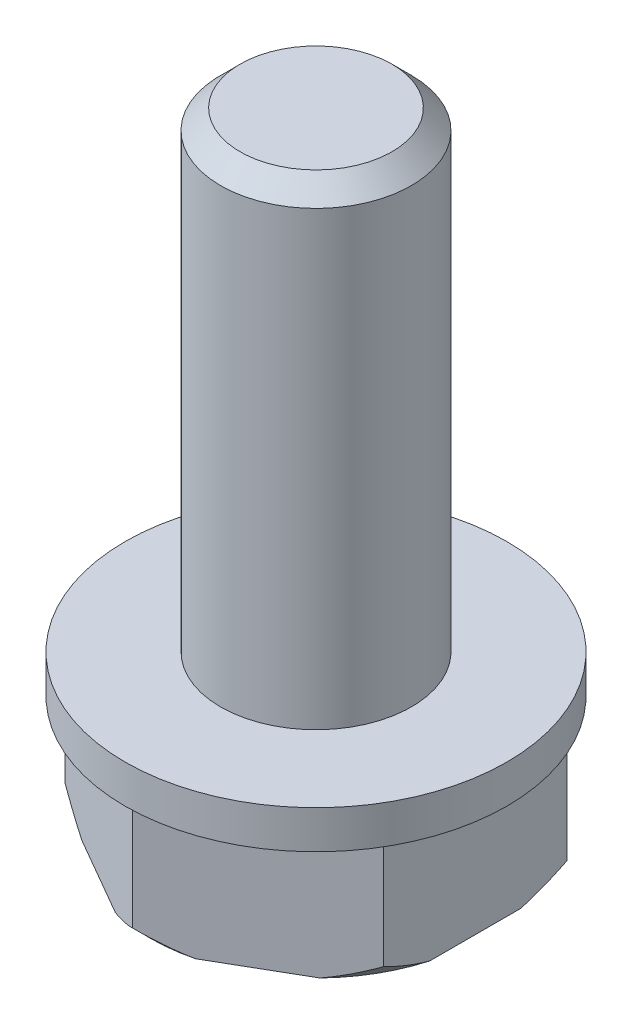
ISO-10303-21;
HEADER;
FILE_DESCRIPTION(('STEP AP214'),'2;1');
FILE_NAME('part.step','',(''),(''),'','','');
FILE_SCHEMA(('AUTOMOTIVE_DESIGN { 1 0 10303 214 1 1 1 1 }'));
ENDSEC;
DATA;
#1=APPLICATION_CONTEXT('core data for automotive mechanical design processes');
#2=APPLICATION_PROTOCOL_DEFINITION('international standard','automotive_design',2000,#1);
#3=PRODUCT_CONTEXT('',#1,'mechanical');
#4=PRODUCT('Part','Part','',(#3));
#5=PRODUCT_RELATED_PRODUCT_CATEGORY('part','',(#4));
#6=PRODUCT_DEFINITION_FORMATION('','',#4);
#7=PRODUCT_DEFINITION_CONTEXT('part definition',#1,'design');
#8=PRODUCT_DEFINITION('design','',#6,#7);
#9=PRODUCT_DEFINITION_SHAPE('','',#8);
#10=(LENGTH_UNIT() NAMED_UNIT(*) SI_UNIT(.MILLI.,.METRE.));
#11=(NAMED_UNIT(*) PLANE_ANGLE_UNIT() SI_UNIT($,.RADIAN.));
#12=(NAMED_UNIT(*) SI_UNIT($,.STERADIAN.) SOLID_ANGLE_UNIT());
#13=UNCERTAINTY_MEASURE_WITH_UNIT(LENGTH_MEASURE(1.E-05),#10,'distance_accuracy_value','');
#14=(GEOMETRIC_REPRESENTATION_CONTEXT(3) GLOBAL_UNCERTAINTY_ASSIGNED_CONTEXT((#13)) GLOBAL_UNIT_ASSIGNED_CONTEXT((#10,
#11,#12)) REPRESENTATION_CONTEXT('',''));
#15=CARTESIAN_POINT('',(0.,0.,0.));
#16=DIRECTION('',(0.,0.,1.));
#17=DIRECTION('',(1.,0.,0.));
#18=AXIS2_PLACEMENT_3D('',#15,#16,#17);
#19=CARTESIAN_POINT('',(-12.6776695296637,96.5,14.7909181837156));
#20=DIRECTION('',(-0.5,0.,0.866025403784439));
#21=DIRECTION('',(0.866025403784439,0.,0.5));
#22=AXIS2_PLACEMENT_3D('',#19,#20,#21);
#23=PLANE('',#22);
#24=DIRECTION('',(0.,-1.,0.));
#25=VECTOR('',#24,1.);
#26=CARTESIAN_POINT('',(-12.6776695296637,96.5,14.7909181837156));
#27=LINE('',#26,#25);
#28=CARTESIAN_POINT('',(-12.6776695296637,50.5,14.7909181837156));
#29=VERTEX_POINT('',#28);
#30=CARTESIAN_POINT('',(-12.6776695296637,47.0735026918963,14.7909181837156));
#31=VERTEX_POINT('',#30);
#32=EDGE_CURVE('E11',#29,#31,#27,.T.);
#33=ORIENTED_EDGE('',*,*,#32,.T.);
#34=CARTESIAN_POINT('',(-13.9407378419784,46.5,14.0616853535958));
#35=CARTESIAN_POINT('',(-13.8888852998626,46.5164440766261,14.091623938227));
#36=CARTESIAN_POINT('',(-13.8372495435169,46.5337687545802,14.1214486324146));
#37=CARTESIAN_POINT('',(-13.7338516018748,46.5702823086314,14.1811796574282));
#38=CARTESIAN_POINT('',(-13.6820943622336,46.5894897238432,14.2110832271335));
#39=CARTESIAN_POINT('',(-13.5783633971793,46.6297670931508,14.2710096812821));
#40=CARTESIAN_POINT('',(-13.5263958373998,46.6508582920278,14.3010289273305));
#41=CARTESIAN_POINT('',(-13.4221600511645,46.6949003649628,14.3612296351021));
#42=CARTESIAN_POINT('',(-13.3698991333133,46.7178745106764,14.3914067018588));
#43=CARTESIAN_POINT('',(-13.2649997798865,46.7656807395659,14.4519664939412));
#44=CARTESIAN_POINT('',(-13.212369709376,46.7905375181192,14.4823441822286));
#45=CARTESIAN_POINT('',(-13.1066617384088,46.8421079012049,14.5433494931069));
#46=CARTESIAN_POINT('',(-13.0535931424491,46.8688470805479,14.5739715894766));
#47=CARTESIAN_POINT('',(-12.9469443837856,46.9241810640024,14.6355096377957));
#48=CARTESIAN_POINT('',(-12.8933743396931,46.9528018406309,14.6664197250956));
#49=CARTESIAN_POINT('',(-12.7856642307774,47.0119007649667,14.7285774640249));
#50=CARTESIAN_POINT('',(-12.7315349477506,47.042404941688,14.7598190718213));
#51=CARTESIAN_POINT('',(-12.6776695296637,47.0735026918963,14.7909181837156));
#52=B_SPLINE_CURVE_WITH_KNOTS('',3,(#34,#35,#36,#37,#38,#39,#40,#41,#42,#43,#44,#45,#46,#47,#48,
#49,#50,#51),.UNSPECIFIED.,.F.,.F.,(4,2,2,2,2,2,2,2,4),(0.,0.186265222277092,0.374595608167035,
0.565412784427951,0.759111232115713,0.956057798253882,1.15659171756843,1.36102506604505,
1.56964356219137),.UNSPECIFIED.);
#53=CARTESIAN_POINT('',(-13.9407378419784,46.5,14.0616853535958));
#54=VERTEX_POINT('',#53);
#55=EDGE_CURVE('E284',#54,#31,#52,.T.);
#56=ORIENTED_EDGE('',*,*,#55,.F.);
#57=DIRECTION('',(0.866025403784439,0.,0.5));
#58=VECTOR('',#57,1.);
#59=CARTESIAN_POINT('',(-11.2776695296637,46.5,15.5992085605811));
#60=LINE('',#59,#58);
#61=CARTESIAN_POINT('',(-16.414601217349,46.5,12.6333996678872));
#62=VERTEX_POINT('',#61);
#63=EDGE_CURVE('E277',#62,#54,#60,.T.);
#64=ORIENTED_EDGE('',*,*,#63,.F.);
#65=CARTESIAN_POINT('',(-17.6776695296637,47.0735026918963,11.9041668377674));
#66=CARTESIAN_POINT('',(-17.6238041996847,47.042404941688,11.9352661022691));
#67=CARTESIAN_POINT('',(-17.5696835321645,47.0119007649667,11.9665226325607));
#68=CARTESIAN_POINT('',(-17.4619982967521,46.9528018406309,12.0287234536614));
#69=CARTESIAN_POINT('',(-17.4084443538709,46.9241810640024,12.0596614290774));
#70=CARTESIAN_POINT('',(-17.3018264613955,46.8688470805479,12.1212529392026));
#71=CARTESIAN_POINT('',(-17.2487726500423,46.8421079012049,12.1519006432619));
#72=CARTESIAN_POINT('',(-17.1430865155724,46.7905375181192,12.2129437760629));
#73=CARTESIAN_POINT('',(-17.090463630552,46.7656807395659,12.2433339099842));
#74=CARTESIAN_POINT('',(-16.9855676354474,46.7178745106764,12.3038995188512));
#75=CARTESIAN_POINT('',(-16.9333030700988,46.6949003649628,12.3340702679571));
#76=CARTESIAN_POINT('',(-16.829049834725,46.6508582920278,12.3942407529346));
#77=CARTESIAN_POINT('',(-16.777068625155,46.6297670931507,12.424236356852));
#78=CARTESIAN_POINT('',(-16.6733053109764,46.5894897238432,12.4841067806739));
#79=CARTESIAN_POINT('',(-16.6215294401272,46.5702823086314,12.5139780801803));
#80=CARTESIAN_POINT('',(-16.5181018842503,46.5337687545802,12.5736578118346));
#81=CARTESIAN_POINT('',(-16.4664550632509,46.5164440766261,12.6034633414798));
#82=CARTESIAN_POINT('',(-16.414601217349,46.5,12.6333996678872));
#83=B_SPLINE_CURVE_WITH_KNOTS('',3,(#65,#66,#67,#68,#69,#70,#71,#72,#73,#74,#75,#76,#77,#78,#79,
#80,#81,#82),.UNSPECIFIED.,.F.,.F.,(4,2,2,2,2,2,2,2,4),(0.,0.208618496146335,0.413051844622961,
0.613585763937521,0.810532330075691,1.00423077776346,1.19504795402437,1.38337833991431,
1.56964356219139),.UNSPECIFIED.);
#84=CARTESIAN_POINT('',(-17.6776695296637,47.0735026918963,11.9041668377674));
#85=VERTEX_POINT('',#84);
#86=EDGE_CURVE('E395',#85,#62,#83,.T.);
#87=ORIENTED_EDGE('',*,*,#86,.F.);
#88=DIRECTION('',(0.,-1.,0.));
#89=VECTOR('',#88,1.);
#90=CARTESIAN_POINT('',(-17.6776695296637,96.5,11.9041668377674));
#91=LINE('',#90,#89);
#92=CARTESIAN_POINT('',(-17.6776695296637,50.5,11.9041668377674));
#93=VERTEX_POINT('',#92);
#94=EDGE_CURVE('E64',#93,#85,#91,.T.);
#95=ORIENTED_EDGE('',*,*,#94,.F.);
#96=DIRECTION('',(-0.866025403784439,0.,-0.5));
#97=VECTOR('',#96,1.);
#98=CARTESIAN_POINT('',(-12.9276695296637,50.5,14.6465806164181));
#99=LINE('',#98,#97);
#100=EDGE_CURVE('E403',#29,#93,#99,.T.);
#101=ORIENTED_EDGE('',*,*,#100,.F.);
#102=EDGE_LOOP('',(#33,#56,#64,#87,#95,#101));
#103=FACE_BOUND('',#102,.T.);
#104=ADVANCED_FACE('F16',(#103),#23,.F.);
#105=CARTESIAN_POINT('',(-12.6776695296637,96.5,20.5644208756118));
#106=DIRECTION('',(-1.,0.,0.));
#107=DIRECTION('',(0.,0.,1.));
#108=AXIS2_PLACEMENT_3D('',#105,#106,#107);
#109=PLANE('',#108);
#110=DIRECTION('',(0.,-1.,0.));
#111=VECTOR('',#110,1.);
#112=CARTESIAN_POINT('',(-12.6776695296637,96.5,20.5644208756118));
#113=LINE('',#112,#111);
#114=CARTESIAN_POINT('',(-12.6776695296637,50.5,20.5644208756118));
#115=VERTEX_POINT('',#114);
#116=CARTESIAN_POINT('',(-12.6776695296637,47.0735026918963,20.5644208756118));
#117=VERTEX_POINT('',#116);
#118=EDGE_CURVE('E433',#115,#117,#113,.T.);
#119=ORIENTED_EDGE('',*,*,#118,.T.);
#120=CARTESIAN_POINT('',(-12.6776695296637,46.5,19.1059552153723));
#121=CARTESIAN_POINT('',(-12.6776708334498,46.5164440766261,19.1658301264109));
#122=CARTESIAN_POINT('',(-12.6776818981035,46.5337687545802,19.2254603502437));
#123=CARTESIAN_POINT('',(-12.6777115123383,46.5702823086314,19.3448711069116));
#124=CARTESIAN_POINT('',(-12.6777301435463,46.5894897238432,19.4046459761233));
#125=CARTESIAN_POINT('',(-12.6777624926705,46.6297670931507,19.5244428540937));
#126=CARTESIAN_POINT('',(-12.6777761424612,46.6508582920278,19.5844577040596));
#127=CARTESIAN_POINT('',(-12.6777935915996,46.6949003649628,19.7048288968087));
#128=CARTESIAN_POINT('',(-12.677797239097,46.7178745106764,19.7651767126713));
#129=CARTESIAN_POINT('',(-12.6777938807748,46.7656807395659,19.8863021136206));
#130=CARTESIAN_POINT('',(-12.6777866952847,46.7905375181192,19.9470699358293));
#131=CARTESIAN_POINT('',(-12.6777648587874,46.8421079012049,20.0691183795086));
#132=CARTESIAN_POINT('',(-12.677750074181,46.8688470805479,20.1303881799377));
#133=CARTESIAN_POINT('',(-12.6777192079928,46.9241810640024,20.2535177383819));
#134=CARTESIAN_POINT('',(-12.6777031067814,46.9528018406309,20.3153658010979));
#135=CARTESIAN_POINT('',(-12.6776782332782,47.0119007649667,20.4397243611279));
#136=CARTESIAN_POINT('',(-12.6776696177716,47.042404941688,20.502222499216));
#137=CARTESIAN_POINT('',(-12.6776695296637,47.0735026918963,20.5644208756118));
#138=B_SPLINE_CURVE_WITH_KNOTS('',3,(#120,#121,#122,#123,#124,#125,#126,#127,#128,#129,#130,
#131,#132,#133,#134,#135,#136,#137),.UNSPECIFIED.,.F.,.F.,(4,2,2,2,2,2,2,2,4),(0.,
0.186265222277086,0.37459560816702,0.565412784427934,0.759111232115698,0.956057798253869,
1.15659171756843,1.36102506604505,1.56964356219139),.UNSPECIFIED.);
#139=CARTESIAN_POINT('',(-12.6776695296637,46.5,19.1059552153723));
#140=VERTEX_POINT('',#139);
#141=EDGE_CURVE('E29',#140,#117,#138,.T.);
#142=ORIENTED_EDGE('',*,*,#141,.F.);
#143=DIRECTION('',(0.,0.,1.));
#144=VECTOR('',#143,1.);
#145=CARTESIAN_POINT('',(-12.6776695296637,46.5,17.6776695296637));
#146=LINE('',#145,#144);
#147=CARTESIAN_POINT('',(-12.6776695296637,46.5,16.2493838439551));
#148=VERTEX_POINT('',#147);
#149=EDGE_CURVE('E276',#148,#140,#146,.T.);
#150=ORIENTED_EDGE('',*,*,#149,.F.);
#151=CARTESIAN_POINT('',(-12.6776695296637,47.0735026918963,14.7909181837156));
#152=CARTESIAN_POINT('',(-12.6776696177716,47.0424049416879,14.8531165601115));
#153=CARTESIAN_POINT('',(-12.6776782332782,47.0119007649667,14.9156146981996));
#154=CARTESIAN_POINT('',(-12.6777031067814,46.9528018406309,15.0399732582295));
#155=CARTESIAN_POINT('',(-12.6777192079928,46.9241810640024,15.1018213209455));
#156=CARTESIAN_POINT('',(-12.677750074181,46.8688470805479,15.2249508793897));
#157=CARTESIAN_POINT('',(-12.6777648587874,46.8421079012049,15.2862206798188));
#158=CARTESIAN_POINT('',(-12.6777866952847,46.7905375181192,15.4082691234981));
#159=CARTESIAN_POINT('',(-12.6777938807748,46.7656807395659,15.4690369457068));
#160=CARTESIAN_POINT('',(-12.677797239097,46.7178745106764,15.5901623466562));
#161=CARTESIAN_POINT('',(-12.6777935915996,46.6949003649628,15.6505101625187));
#162=CARTESIAN_POINT('',(-12.6777761424612,46.6508582920278,15.7708813552679));
#163=CARTESIAN_POINT('',(-12.6777624926706,46.6297670931507,15.8308962052337));
#164=CARTESIAN_POINT('',(-12.6777301435463,46.5894897238432,15.9506930832041));
#165=CARTESIAN_POINT('',(-12.6777115123383,46.5702823086314,16.0104679524158));
#166=CARTESIAN_POINT('',(-12.6776818981035,46.5337687545802,16.1298787090837));
#167=CARTESIAN_POINT('',(-12.6776708334498,46.5164440766261,16.1895089329165));
#168=CARTESIAN_POINT('',(-12.6776695296637,46.5,16.2493838439551));
#169=B_SPLINE_CURVE_WITH_KNOTS('',3,(#151,#152,#153,#154,#155,#156,#157,#158,#159,#160,#161,
#162,#163,#164,#165,#166,#167,#168),.UNSPECIFIED.,.F.,.F.,(4,2,2,2,2,2,2,2,4),(0.,
0.208618496146355,0.413051844622992,0.613585763937557,0.810532330075726,1.00423077776349,
1.19504795402439,1.38337833991431,1.56964356219138),.UNSPECIFIED.);
#170=EDGE_CURVE('E446',#31,#148,#169,.T.);
#171=ORIENTED_EDGE('',*,*,#170,.F.);
#172=ORIENTED_EDGE('',*,*,#32,.F.);
#173=DIRECTION('',(0.,0.,-1.));
#174=VECTOR('',#173,1.);
#175=CARTESIAN_POINT('',(-12.6776695296637,50.5,17.6776695296637));
#176=LINE('',#175,#174);
#177=EDGE_CURVE('E408',#115,#29,#176,.T.);
#178=ORIENTED_EDGE('',*,*,#177,.F.);
#179=EDGE_LOOP('',(#119,#142,#150,#171,#172,#178));
#180=FACE_BOUND('',#179,.T.);
#181=ADVANCED_FACE('F222',(#180),#109,.F.);
#182=CARTESIAN_POINT('',(-17.6776695296637,47.3,17.6776695296637));
#183=DIRECTION('',(0.,1.,0.));
#184=DIRECTION('',(0.,0.,1.));
#185=AXIS2_PLACEMENT_3D('',#182,#183,#184);
#186=CONICAL_SURFACE('',#185,6.,0.785398163397448);
#187=CARTESIAN_POINT('',(-17.6776695296637,46.5,17.6776695296637));
#188=DIRECTION('',(0.,-1.,0.));
#189=DIRECTION('',(0.,0.,-1.));
#190=AXIS2_PLACEMENT_3D('',#187,#188,#189);
#191=CIRCLE('',#190,5.2);
#192=CARTESIAN_POINT('',(-13.9407378419784,46.5,21.2936537057316));
#193=VERTEX_POINT('',#192);
#194=EDGE_CURVE('E244',#140,#193,#191,.T.);
#195=ORIENTED_EDGE('',*,*,#194,.F.);
#196=ORIENTED_EDGE('',*,*,#141,.T.);
#197=CARTESIAN_POINT('',(-12.6776695296637,47.0735026918963,20.5644208756118));
#198=CARTESIAN_POINT('',(-12.7315349477506,47.042404941688,20.5955199875061));
#199=CARTESIAN_POINT('',(-12.7856642307774,47.0119007649667,20.6267615953025));
#200=CARTESIAN_POINT('',(-12.8933743396931,46.9528018406309,20.6889193342318));
#201=CARTESIAN_POINT('',(-12.9469443837856,46.9241810640024,20.7198294215318));
#202=CARTESIAN_POINT('',(-13.0535931424492,46.8688470805479,20.7813674698508));
#203=CARTESIAN_POINT('',(-13.1066617384088,46.8421079012049,20.8119895662206));
#204=CARTESIAN_POINT('',(-13.212369709376,46.7905375181192,20.8729948770988));
#205=CARTESIAN_POINT('',(-13.2649997798865,46.7656807395659,20.9033725653862));
#206=CARTESIAN_POINT('',(-13.3698991333133,46.7178745106764,20.9639323574686));
#207=CARTESIAN_POINT('',(-13.4221600511645,46.6949003649628,20.9941094242253));
#208=CARTESIAN_POINT('',(-13.5263958373999,46.6508582920278,21.054310131997));
#209=CARTESIAN_POINT('',(-13.5783633971793,46.6297670931507,21.0843293780454));
#210=CARTESIAN_POINT('',(-13.6820943622336,46.5894897238432,21.1442558321939));
#211=CARTESIAN_POINT('',(-13.7338516018749,46.5702823086314,21.1741594018992));
#212=CARTESIAN_POINT('',(-13.8372495435169,46.5337687545802,21.2338904269128));
#213=CARTESIAN_POINT('',(-13.8888852998626,46.5164440766261,21.2637151211004));
#214=CARTESIAN_POINT('',(-13.9407378419784,46.5,21.2936537057316));
#215=B_SPLINE_CURVE_WITH_KNOTS('',3,(#197,#198,#199,#200,#201,#202,#203,#204,#205,#206,#207,
#208,#209,#210,#211,#212,#213,#214),.UNSPECIFIED.,.F.,.F.,(4,2,2,2,2,2,2,2,4),(0.,
0.208618496146344,0.413051844622975,0.613585763937536,0.810532330075708,1.00423077776347,
1.19504795402438,1.38337833991431,1.56964356219139),.UNSPECIFIED.);
#216=EDGE_CURVE('E208',#117,#193,#215,.T.);
#217=ORIENTED_EDGE('',*,*,#216,.T.);
#218=EDGE_LOOP('',(#195,#196,#217));
#219=FACE_BOUND('',#218,.T.);
#220=ADVANCED_FACE('F214',(#219),#186,.T.);
#221=CARTESIAN_POINT('',(-17.6776695296637,47.3,17.6776695296637));
#222=DIRECTION('',(0.,1.,0.));
#223=DIRECTION('',(0.,0.,1.));
#224=AXIS2_PLACEMENT_3D('',#221,#222,#223);
#225=CONICAL_SURFACE('',#224,6.,0.785398163397448);
#226=CARTESIAN_POINT('',(-17.6776695296637,46.5,17.6776695296637));
#227=DIRECTION('',(0.,-1.,0.));
#228=DIRECTION('',(0.,0.,-1.));
#229=AXIS2_PLACEMENT_3D('',#226,#227,#228);
#230=CIRCLE('',#229,5.2);
#231=EDGE_CURVE('E273',#54,#148,#230,.T.);
#232=ORIENTED_EDGE('',*,*,#231,.F.);
#233=ORIENTED_EDGE('',*,*,#55,.T.);
#234=ORIENTED_EDGE('',*,*,#170,.T.);
#235=EDGE_LOOP('',(#232,#233,#234));
#236=FACE_BOUND('',#235,.T.);
#237=ADVANCED_FACE('F18',(#236),#225,.T.);
#238=CARTESIAN_POINT('',(-17.6776695296637,47.3,17.6776695296637));
#239=DIRECTION('',(0.,1.,0.));
#240=DIRECTION('',(0.,0.,1.));
#241=AXIS2_PLACEMENT_3D('',#238,#239,#240);
#242=CONICAL_SURFACE('',#241,6.,0.785398163397448);
#243=CARTESIAN_POINT('',(-17.6776695296637,46.5,17.6776695296637));
#244=DIRECTION('',(0.,-1.,0.));
#245=DIRECTION('',(0.,0.,-1.));
#246=AXIS2_PLACEMENT_3D('',#243,#244,#245);
#247=CIRCLE('',#246,5.2);
#248=CARTESIAN_POINT('',(-18.9407378419784,46.5,12.6333996678872));
#249=VERTEX_POINT('',#248);
#250=EDGE_CURVE('E326',#249,#62,#247,.T.);
#251=ORIENTED_EDGE('',*,*,#250,.F.);
#252=CARTESIAN_POINT('',(-18.9407378419784,46.5,12.6333996678872));
#253=CARTESIAN_POINT('',(-18.8888839960765,46.5164440766261,12.6034633414798));
#254=CARTESIAN_POINT('',(-18.8372371750771,46.5337687545802,12.5736578118346));
#255=CARTESIAN_POINT('',(-18.7338096192002,46.5702823086314,12.5139780801803));
#256=CARTESIAN_POINT('',(-18.682033748351,46.5894897238432,12.4841067806739));
#257=CARTESIAN_POINT('',(-18.5782704341724,46.6297670931507,12.424236356852));
#258=CARTESIAN_POINT('',(-18.5262892246024,46.6508582920278,12.3942407529346));
#259=CARTESIAN_POINT('',(-18.4220359892286,46.6949003649628,12.3340702679571));
#260=CARTESIAN_POINT('',(-18.36977142388,46.7178745106764,12.3038995188512));
#261=CARTESIAN_POINT('',(-18.2648754287754,46.7656807395659,12.2433339099842));
#262=CARTESIAN_POINT('',(-18.212252543755,46.7905375181192,12.2129437760629));
#263=CARTESIAN_POINT('',(-18.106566409285,46.8421079012049,12.1519006432619));
#264=CARTESIAN_POINT('',(-18.0535125979318,46.8688470805479,12.1212529392026));
#265=CARTESIAN_POINT('',(-17.9468947054565,46.9241810640024,12.0596614290774));
#266=CARTESIAN_POINT('',(-17.8933407625753,46.9528018406309,12.0287234536614));
#267=CARTESIAN_POINT('',(-17.7856555271629,47.0119007649667,11.9665226325607));
#268=CARTESIAN_POINT('',(-17.7315348596427,47.0424049416879,11.9352661022691));
#269=CARTESIAN_POINT('',(-17.6776695296637,47.0735026918963,11.9041668377675));
#270=B_SPLINE_CURVE_WITH_KNOTS('',3,(#252,#253,#254,#255,#256,#257,#258,#259,#260,#261,#262,
#263,#264,#265,#266,#267,#268,#269),.UNSPECIFIED.,.F.,.F.,(4,2,2,2,2,2,2,2,4),(0.,
0.186265222277095,0.374595608167032,0.565412784427949,0.759111232115718,0.956057798253885,
1.15659171756844,1.36102506604506,1.56964356219139),.UNSPECIFIED.);
#271=EDGE_CURVE('E323',#249,#85,#270,.T.);
#272=ORIENTED_EDGE('',*,*,#271,.T.);
#273=ORIENTED_EDGE('',*,*,#86,.T.);
#274=EDGE_LOOP('',(#251,#272,#273));
#275=FACE_BOUND('',#274,.T.);
#276=ADVANCED_FACE('F366',(#275),#242,.T.);
#277=CARTESIAN_POINT('',(-17.6776695296637,51.7,17.6776695296637));
#278=DIRECTION('',(0.,-1.,0.));
#279=DIRECTION('',(0.,0.,-1.));
#280=AXIS2_PLACEMENT_3D('',#277,#278,#279);
#281=PLANE('',#280);
#282=CARTESIAN_POINT('',(-17.6776695296637,51.7,17.6776695296637));
#283=DIRECTION('',(0.,-1.,0.));
#284=DIRECTION('',(0.,0.,-1.));
#285=AXIS2_PLACEMENT_3D('',#282,#283,#284);
#286=CIRCLE('',#285,3.);
#287=CARTESIAN_POINT('',(-17.6776695296637,51.7,14.6776695296637));
#288=VERTEX_POINT('',#287);
#289=EDGE_CURVE('E418',#288,#288,#286,.T.);
#290=ORIENTED_EDGE('',*,*,#289,.T.);
#291=EDGE_LOOP('',(#290));
#292=FACE_BOUND('',#291,.T.);
#293=CARTESIAN_POINT('',(-17.6776695296637,51.7,17.6776695296637));
#294=DIRECTION('',(0.,-1.,0.));
#295=DIRECTION('',(0.,0.,-1.));
#296=AXIS2_PLACEMENT_3D('',#293,#294,#295);
#297=CIRCLE('',#296,6.);
#298=CARTESIAN_POINT('',(-17.6776695296637,51.7,11.6776695296637));
#299=VERTEX_POINT('',#298);
#300=EDGE_CURVE('E415',#299,#299,#297,.T.);
#301=ORIENTED_EDGE('',*,*,#300,.F.);
#302=EDGE_LOOP('',(#301));
#303=FACE_BOUND('',#302,.T.);
#304=ADVANCED_FACE('F255',(#292,#303),#281,.F.);
#305=CARTESIAN_POINT('',(-17.6776695296637,47.3,17.6776695296637));
#306=DIRECTION('',(0.,1.,0.));
#307=DIRECTION('',(0.,0.,1.));
#308=AXIS2_PLACEMENT_3D('',#305,#306,#307);
#309=CONICAL_SURFACE('',#308,6.,0.785398163397448);
#310=CARTESIAN_POINT('',(-17.6776695296637,46.5,17.6776695296637));
#311=DIRECTION('',(0.,-1.,0.));
#312=DIRECTION('',(0.,0.,-1.));
#313=AXIS2_PLACEMENT_3D('',#310,#311,#312);
#314=CIRCLE('',#313,5.2);
#315=CARTESIAN_POINT('',(-22.6776695296637,46.5,16.2493838439551));
#316=VERTEX_POINT('',#315);
#317=CARTESIAN_POINT('',(-21.414601217349,46.5,14.0616853535958));
#318=VERTEX_POINT('',#317);
#319=EDGE_CURVE('E130',#316,#318,#314,.T.);
#320=ORIENTED_EDGE('',*,*,#319,.F.);
#321=CARTESIAN_POINT('',(-22.6776695296637,46.5,16.2493838439551));
#322=CARTESIAN_POINT('',(-22.6776682258776,46.5164440766261,16.1895089329165));
#323=CARTESIAN_POINT('',(-22.6776571612239,46.5337687545802,16.1298787090837));
#324=CARTESIAN_POINT('',(-22.6776275469891,46.5702823086314,16.0104679524158));
#325=CARTESIAN_POINT('',(-22.6776089157811,46.5894897238432,15.9506930832041));
#326=CARTESIAN_POINT('',(-22.6775765666569,46.6297670931507,15.8308962052337));
#327=CARTESIAN_POINT('',(-22.6775629168662,46.6508582920278,15.7708813552678));
#328=CARTESIAN_POINT('',(-22.6775454677278,46.6949003649628,15.6505101625187));
#329=CARTESIAN_POINT('',(-22.6775418202305,46.7178745106764,15.5901623466562));
#330=CARTESIAN_POINT('',(-22.6775451785526,46.7656807395659,15.4690369457068));
#331=CARTESIAN_POINT('',(-22.6775523640427,46.7905375181192,15.4082691234981));
#332=CARTESIAN_POINT('',(-22.67757420054,46.8421079012049,15.2862206798188));
#333=CARTESIAN_POINT('',(-22.6775889851464,46.8688470805479,15.2249508793897));
#334=CARTESIAN_POINT('',(-22.6776198513346,46.9241810640024,15.1018213209455));
#335=CARTESIAN_POINT('',(-22.677635952546,46.9528018406309,15.0399732582295));
#336=CARTESIAN_POINT('',(-22.6776608260492,47.0119007649668,14.9156146981995));
#337=CARTESIAN_POINT('',(-22.6776694415558,47.042404941688,14.8531165601114));
#338=CARTESIAN_POINT('',(-22.6776695296637,47.0735026918963,14.7909181837156));
#339=B_SPLINE_CURVE_WITH_KNOTS('',3,(#321,#322,#323,#324,#325,#326,#327,#328,#329,#330,#331,
#332,#333,#334,#335,#336,#337,#338),.UNSPECIFIED.,.F.,.F.,(4,2,2,2,2,2,2,2,4),(0.,
0.186265222277089,0.37459560816702,0.565412784427934,0.759111232115705,0.956057798253876,
1.15659171756844,1.36102506604506,1.5696435621914),.UNSPECIFIED.);
#340=CARTESIAN_POINT('',(-22.6776695296637,47.0735026918963,14.7909181837156));
#341=VERTEX_POINT('',#340);
#342=EDGE_CURVE('E118',#316,#341,#339,.T.);
#343=ORIENTED_EDGE('',*,*,#342,.T.);
#344=CARTESIAN_POINT('',(-22.6776695296637,47.0735026918963,14.7909181837156));
#345=CARTESIAN_POINT('',(-22.6238041115768,47.042404941688,14.7598190718213));
#346=CARTESIAN_POINT('',(-22.56967482855,47.0119007649667,14.7285774640249));
#347=CARTESIAN_POINT('',(-22.4619647196343,46.9528018406309,14.6664197250955));
#348=CARTESIAN_POINT('',(-22.4083946755418,46.9241810640024,14.6355096377956));
#349=CARTESIAN_POINT('',(-22.3017459168782,46.8688470805479,14.5739715894766));
#350=CARTESIAN_POINT('',(-22.2486773209186,46.8421079012049,14.5433494931068));
#351=CARTESIAN_POINT('',(-22.1429693499514,46.7905375181192,14.4823441822286));
#352=CARTESIAN_POINT('',(-22.0903392794409,46.7656807395659,14.4519664939412));
#353=CARTESIAN_POINT('',(-21.9854399260141,46.7178745106764,14.3914067018588));
#354=CARTESIAN_POINT('',(-21.9331790081629,46.6949003649628,14.3612296351021));
#355=CARTESIAN_POINT('',(-21.8289432219275,46.6508582920278,14.3010289273304));
#356=CARTESIAN_POINT('',(-21.7769756621481,46.6297670931507,14.271009681282));
#357=CARTESIAN_POINT('',(-21.6732446970938,46.5894897238432,14.2110832271335));
#358=CARTESIAN_POINT('',(-21.6214874574526,46.5702823086314,14.1811796574282));
#359=CARTESIAN_POINT('',(-21.5180895158105,46.5337687545802,14.1214486324146));
#360=CARTESIAN_POINT('',(-21.4664537594648,46.5164440766261,14.091623938227));
#361=CARTESIAN_POINT('',(-21.414601217349,46.5,14.0616853535958));
#362=B_SPLINE_CURVE_WITH_KNOTS('',3,(#344,#345,#346,#347,#348,#349,#350,#351,#352,#353,#354,
#355,#356,#357,#358,#359,#360,#361),.UNSPECIFIED.,.F.,.F.,(4,2,2,2,2,2,2,2,4),(0.,
0.208618496146342,0.413051844622965,0.613585763937522,0.810532330075698,1.00423077776345,
1.19504795402437,1.3833783399143,1.56964356219138),.UNSPECIFIED.);
#363=EDGE_CURVE('E132',#341,#318,#362,.T.);
#364=ORIENTED_EDGE('',*,*,#363,.T.);
#365=EDGE_LOOP('',(#320,#343,#364));
#366=FACE_BOUND('',#365,.T.);
#367=ADVANCED_FACE('F131',(#366),#309,.T.);
#368=CARTESIAN_POINT('',(-17.6776695296637,50.5,17.6776695296637));
#369=DIRECTION('',(0.,-1.,0.));
#370=DIRECTION('',(0.,0.,-1.));
#371=AXIS2_PLACEMENT_3D('',#368,#369,#370);
#372=CYLINDRICAL_SURFACE('',#371,6.);
#373=ORIENTED_EDGE('',*,*,#300,.T.);
#374=EDGE_LOOP('',(#373));
#375=FACE_BOUND('',#374,.T.);
#376=CARTESIAN_POINT('',(-17.6776695296637,50.5,17.6776695296637));
#377=DIRECTION('',(0.,-1.,0.));
#378=DIRECTION('',(0.,0.,-1.));
#379=AXIS2_PLACEMENT_3D('',#376,#377,#378);
#380=CIRCLE('',#379,6.);
#381=CARTESIAN_POINT('',(-17.6776695296637,50.5,11.6776695296637));
#382=VERTEX_POINT('',#381);
#383=EDGE_CURVE('E49',#382,#382,#380,.T.);
#384=ORIENTED_EDGE('',*,*,#383,.F.);
#385=EDGE_LOOP('',(#384));
#386=FACE_BOUND('',#385,.T.);
#387=ADVANCED_FACE('F171',(#375,#386),#372,.T.);
#388=CARTESIAN_POINT('',(-17.6776695296637,96.5,11.9041668377674));
#389=DIRECTION('',(0.5,0.,0.866025403784439));
#390=DIRECTION('',(0.866025403784439,0.,-0.5));
#391=AXIS2_PLACEMENT_3D('',#388,#389,#390);
#392=PLANE('',#391);
#393=ORIENTED_EDGE('',*,*,#94,.T.);
#394=ORIENTED_EDGE('',*,*,#271,.F.);
#395=DIRECTION('',(0.866025403784439,0.,-0.5));
#396=VECTOR('',#395,1.);
#397=CARTESIAN_POINT('',(-16.2776695296637,46.5,11.095876460902));
#398=LINE('',#397,#396);
#399=EDGE_CURVE('E137',#318,#249,#398,.T.);
#400=ORIENTED_EDGE('',*,*,#399,.F.);
#401=ORIENTED_EDGE('',*,*,#363,.F.);
#402=DIRECTION('',(0.,-1.,0.));
#403=VECTOR('',#402,1.);
#404=CARTESIAN_POINT('',(-22.6776695296637,96.5,14.7909181837156));
#405=LINE('',#404,#403);
#406=CARTESIAN_POINT('',(-22.6776695296637,50.5,14.7909181837156));
#407=VERTEX_POINT('',#406);
#408=EDGE_CURVE('E57',#407,#341,#405,.T.);
#409=ORIENTED_EDGE('',*,*,#408,.F.);
#410=DIRECTION('',(-0.866025403784439,0.,0.5));
#411=VECTOR('',#410,1.);
#412=CARTESIAN_POINT('',(-17.9276695296637,50.5,12.0485044050648));
#413=LINE('',#412,#411);
#414=EDGE_CURVE('E398',#93,#407,#413,.T.);
#415=ORIENTED_EDGE('',*,*,#414,.F.);
#416=EDGE_LOOP('',(#393,#394,#400,#401,#409,#415));
#417=FACE_BOUND('',#416,.T.);
#418=ADVANCED_FACE('F358',(#417),#392,.F.);
#419=CARTESIAN_POINT('',(-22.6776695296637,96.5,14.7909181837156));
#420=DIRECTION('',(1.,0.,0.));
#421=DIRECTION('',(0.,0.,-1.));
#422=AXIS2_PLACEMENT_3D('',#419,#420,#421);
#423=PLANE('',#422);
#424=ORIENTED_EDGE('',*,*,#408,.T.);
#425=ORIENTED_EDGE('',*,*,#342,.F.);
#426=DIRECTION('',(0.,0.,-1.));
#427=VECTOR('',#426,1.);
#428=CARTESIAN_POINT('',(-22.6776695296637,46.5,17.6776695296637));
#429=LINE('',#428,#427);
#430=CARTESIAN_POINT('',(-22.6776695296637,46.5,19.1059552153723));
#431=VERTEX_POINT('',#430);
#432=EDGE_CURVE('E123',#431,#316,#429,.T.);
#433=ORIENTED_EDGE('',*,*,#432,.F.);
#434=CARTESIAN_POINT('',(-22.6776695296637,47.0735026918963,20.5644208756118));
#435=CARTESIAN_POINT('',(-22.6776694415558,47.0424049416879,20.502222499216));
#436=CARTESIAN_POINT('',(-22.6776608260492,47.0119007649667,20.4397243611279));
#437=CARTESIAN_POINT('',(-22.677635952546,46.9528018406309,20.3153658010979));
#438=CARTESIAN_POINT('',(-22.6776198513346,46.9241810640024,20.2535177383819));
#439=CARTESIAN_POINT('',(-22.6775889851464,46.8688470805479,20.1303881799377));
#440=CARTESIAN_POINT('',(-22.67757420054,46.8421079012049,20.0691183795086));
#441=CARTESIAN_POINT('',(-22.6775523640427,46.7905375181192,19.9470699358293));
#442=CARTESIAN_POINT('',(-22.6775451785526,46.7656807395659,19.8863021136206));
#443=CARTESIAN_POINT('',(-22.6775418202304,46.7178745106764,19.7651767126712));
#444=CARTESIAN_POINT('',(-22.6775454677278,46.6949003649628,19.7048288968087));
#445=CARTESIAN_POINT('',(-22.6775629168662,46.6508582920278,19.5844577040595));
#446=CARTESIAN_POINT('',(-22.6775765666568,46.6297670931507,19.5244428540937));
#447=CARTESIAN_POINT('',(-22.6776089157811,46.5894897238432,19.4046459761233));
#448=CARTESIAN_POINT('',(-22.6776275469891,46.5702823086314,19.3448711069116));
#449=CARTESIAN_POINT('',(-22.6776571612239,46.5337687545802,19.2254603502437));
#450=CARTESIAN_POINT('',(-22.6776682258776,46.5164440766261,19.165830126411));
#451=CARTESIAN_POINT('',(-22.6776695296637,46.5,19.1059552153723));
#452=B_SPLINE_CURVE_WITH_KNOTS('',3,(#434,#435,#436,#437,#438,#439,#440,#441,#442,#443,#444,
#445,#446,#447,#448,#449,#450,#451),.UNSPECIFIED.,.F.,.F.,(4,2,2,2,2,2,2,2,4),(0.,
0.208618496146364,0.413051844623002,0.613585763937568,0.810532330075742,1.0042307777635,
1.1950479540244,1.38337833991432,1.56964356219138),.UNSPECIFIED.);
#453=CARTESIAN_POINT('',(-22.6776695296637,47.0735026918963,20.5644208756118));
#454=VERTEX_POINT('',#453);
#455=EDGE_CURVE('E154',#454,#431,#452,.T.);
#456=ORIENTED_EDGE('',*,*,#455,.F.);
#457=DIRECTION('',(0.,-1.,0.));
#458=VECTOR('',#457,1.);
#459=CARTESIAN_POINT('',(-22.6776695296637,96.5,20.5644208756118));
#460=LINE('',#459,#458);
#461=CARTESIAN_POINT('',(-22.6776695296637,50.5,20.5644208756118));
#462=VERTEX_POINT('',#461);
#463=EDGE_CURVE('E432',#462,#454,#460,.T.);
#464=ORIENTED_EDGE('',*,*,#463,.F.);
#465=DIRECTION('',(0.,0.,1.));
#466=VECTOR('',#465,1.);
#467=CARTESIAN_POINT('',(-22.6776695296637,50.5,17.6776695296637));
#468=LINE('',#467,#466);
#469=EDGE_CURVE('E402',#407,#462,#468,.T.);
#470=ORIENTED_EDGE('',*,*,#469,.F.);
#471=EDGE_LOOP('',(#424,#425,#433,#456,#464,#470));
#472=FACE_BOUND('',#471,.T.);
#473=ADVANCED_FACE('F121',(#472),#423,.F.);
#474=CARTESIAN_POINT('',(-11.6776695296637,50.5,17.6776695296637));
#475=DIRECTION('',(0.,1.,0.));
#476=DIRECTION('',(0.,0.,1.));
#477=AXIS2_PLACEMENT_3D('',#474,#475,#476);
#478=PLANE('',#477);
#479=ORIENTED_EDGE('',*,*,#383,.T.);
#480=EDGE_LOOP('',(#479));
#481=FACE_BOUND('',#480,.T.);
#482=ORIENTED_EDGE('',*,*,#177,.T.);
#483=ORIENTED_EDGE('',*,*,#100,.T.);
#484=ORIENTED_EDGE('',*,*,#414,.T.);
#485=ORIENTED_EDGE('',*,*,#469,.T.);
#486=DIRECTION('',(0.866025403784439,0.,0.5));
#487=VECTOR('',#486,1.);
#488=CARTESIAN_POINT('',(-17.9276695296637,50.5,23.3068346542625));
#489=LINE('',#488,#487);
#490=CARTESIAN_POINT('',(-17.6776695296637,50.5,23.4511722215599));
#491=VERTEX_POINT('',#490);
#492=EDGE_CURVE('E143',#462,#491,#489,.T.);
#493=ORIENTED_EDGE('',*,*,#492,.T.);
#494=DIRECTION('',(0.866025403784439,0.,-0.5));
#495=VECTOR('',#494,1.);
#496=CARTESIAN_POINT('',(-12.9276695296637,50.5,20.7087584429092));
#497=LINE('',#496,#495);
#498=EDGE_CURVE('E431',#491,#115,#497,.T.);
#499=ORIENTED_EDGE('',*,*,#498,.T.);
#500=EDGE_LOOP('',(#482,#483,#484,#485,#493,#499));
#501=FACE_BOUND('',#500,.T.);
#502=ADVANCED_FACE('F343',(#481,#501),#478,.F.);
#503=CARTESIAN_POINT('',(-17.6776695296637,66.5,17.6776695296637));
#504=DIRECTION('',(0.,-1.,0.));
#505=DIRECTION('',(0.,0.,-1.));
#506=AXIS2_PLACEMENT_3D('',#503,#504,#505);
#507=CONICAL_SURFACE('',#506,2.3865,0.785398163397446);
#508=CARTESIAN_POINT('',(-17.6776695296637,66.5,17.6776695296637));
#509=DIRECTION('',(0.,-1.,0.));
#510=DIRECTION('',(0.,0.,-1.));
#511=AXIS2_PLACEMENT_3D('',#508,#509,#510);
#512=CIRCLE('',#511,2.3865);
#513=CARTESIAN_POINT('',(-17.6776695296637,66.5,15.2911695296637));
#514=VERTEX_POINT('',#513);
#515=EDGE_CURVE('E410',#514,#514,#512,.T.);
#516=ORIENTED_EDGE('',*,*,#515,.T.);
#517=EDGE_LOOP('',(#516));
#518=FACE_BOUND('',#517,.T.);
#519=CARTESIAN_POINT('',(-17.6776695296637,65.8865,17.6776695296637));
#520=DIRECTION('',(0.,-1.,0.));
#521=DIRECTION('',(0.,0.,-1.));
#522=AXIS2_PLACEMENT_3D('',#519,#520,#521);
#523=CIRCLE('',#522,3.);
#524=CARTESIAN_POINT('',(-17.6776695296637,65.8865,14.6776695296637));
#525=VERTEX_POINT('',#524);
#526=EDGE_CURVE('E417',#525,#525,#523,.T.);
#527=ORIENTED_EDGE('',*,*,#526,.F.);
#528=EDGE_LOOP('',(#527));
#529=FACE_BOUND('',#528,.T.);
#530=ADVANCED_FACE('F477',(#518,#529),#507,.T.);
#531=CARTESIAN_POINT('',(-17.6776695296637,66.5,17.6776695296637));
#532=DIRECTION('',(0.,-1.,0.));
#533=DIRECTION('',(0.,0.,-1.));
#534=AXIS2_PLACEMENT_3D('',#531,#532,#533);
#535=PLANE('',#534);
#536=ORIENTED_EDGE('',*,*,#515,.F.);
#537=EDGE_LOOP('',(#536));
#538=FACE_BOUND('',#537,.T.);
#539=ADVANCED_FACE('F257',(#538),#535,.F.);
#540=CARTESIAN_POINT('',(-17.6776695296637,46.5,17.6776695296637));
#541=DIRECTION('',(0.,-1.,0.));
#542=DIRECTION('',(0.,0.,-1.));
#543=AXIS2_PLACEMENT_3D('',#540,#541,#542);
#544=CYLINDRICAL_SURFACE('',#543,3.);
#545=ORIENTED_EDGE('',*,*,#526,.T.);
#546=EDGE_LOOP('',(#545));
#547=FACE_BOUND('',#546,.T.);
#548=ORIENTED_EDGE('',*,*,#289,.F.);
#549=EDGE_LOOP('',(#548));
#550=FACE_BOUND('',#549,.T.);
#551=ADVANCED_FACE('F481',(#547,#550),#544,.T.);
#552=CARTESIAN_POINT('',(-17.6776695296637,47.3,17.6776695296637));
#553=DIRECTION('',(0.,1.,0.));
#554=DIRECTION('',(0.,0.,1.));
#555=AXIS2_PLACEMENT_3D('',#552,#553,#554);
#556=CONICAL_SURFACE('',#555,6.,0.785398163397448);
#557=CARTESIAN_POINT('',(-17.6776695296637,46.5,17.6776695296637));
#558=DIRECTION('',(0.,-1.,0.));
#559=DIRECTION('',(0.,0.,-1.));
#560=AXIS2_PLACEMENT_3D('',#557,#558,#559);
#561=CIRCLE('',#560,5.2);
#562=CARTESIAN_POINT('',(-16.414601217349,46.5,22.7219393914402));
#563=VERTEX_POINT('',#562);
#564=CARTESIAN_POINT('',(-18.9407378419784,46.5,22.7219393914402));
#565=VERTEX_POINT('',#564);
#566=EDGE_CURVE('E426',#563,#565,#561,.T.);
#567=ORIENTED_EDGE('',*,*,#566,.F.);
#568=CARTESIAN_POINT('',(-16.414601217349,46.5,22.7219393914402));
#569=CARTESIAN_POINT('',(-16.4664550632509,46.5164440766261,22.7518757178476));
#570=CARTESIAN_POINT('',(-16.5181018842503,46.5337687545802,22.7816812474928));
#571=CARTESIAN_POINT('',(-16.6215294401272,46.5702823086314,22.8413609791471));
#572=CARTESIAN_POINT('',(-16.6733053109764,46.5894897238432,22.8712322786535));
#573=CARTESIAN_POINT('',(-16.777068625155,46.6297670931507,22.9311027024754));
#574=CARTESIAN_POINT('',(-16.829049834725,46.6508582920278,22.9610983063928));
#575=CARTESIAN_POINT('',(-16.9333030700988,46.6949003649628,23.0212687913703));
#576=CARTESIAN_POINT('',(-16.9855676354474,46.7178745106764,23.0514395404762));
#577=CARTESIAN_POINT('',(-17.090463630552,46.7656807395659,23.1120051493432));
#578=CARTESIAN_POINT('',(-17.1430865155724,46.7905375181192,23.1423952832645));
#579=CARTESIAN_POINT('',(-17.2487726500423,46.8421079012049,23.2034384160655));
#580=CARTESIAN_POINT('',(-17.3018264613955,46.8688470805479,23.2340861201248));
#581=CARTESIAN_POINT('',(-17.4084443538709,46.9241810640024,23.29567763025));
#582=CARTESIAN_POINT('',(-17.4619982967521,46.9528018406309,23.326615605666));
#583=CARTESIAN_POINT('',(-17.5696835321645,47.0119007649667,23.3888164267667));
#584=CARTESIAN_POINT('',(-17.6238041996847,47.042404941688,23.4200729570583));
#585=CARTESIAN_POINT('',(-17.6776695296637,47.0735026918963,23.45117222156));
#586=B_SPLINE_CURVE_WITH_KNOTS('',3,(#568,#569,#570,#571,#572,#573,#574,#575,#576,#577,#578,
#579,#580,#581,#582,#583,#584,#585),.UNSPECIFIED.,.F.,.F.,(4,2,2,2,2,2,2,2,4),(0.,
0.186265222277088,0.374595608167022,0.565412784427933,0.7591112321157,0.956057798253864,
1.15659171756842,1.36102506604504,1.56964356219138),.UNSPECIFIED.);
#587=CARTESIAN_POINT('',(-17.6776695296637,47.0735026918963,23.4511722215599));
#588=VERTEX_POINT('',#587);
#589=EDGE_CURVE('E673',#563,#588,#586,.T.);
#590=ORIENTED_EDGE('',*,*,#589,.T.);
#591=CARTESIAN_POINT('',(-17.6776695296637,47.0735026918963,23.45117222156));
#592=CARTESIAN_POINT('',(-17.7315348596427,47.042404941688,23.4200729570584));
#593=CARTESIAN_POINT('',(-17.7856555271629,47.0119007649667,23.3888164267667));
#594=CARTESIAN_POINT('',(-17.8933407625753,46.9528018406309,23.326615605666));
#595=CARTESIAN_POINT('',(-17.9468947054565,46.9241810640024,23.29567763025));
#596=CARTESIAN_POINT('',(-18.0535125979319,46.8688470805479,23.2340861201248));
#597=CARTESIAN_POINT('',(-18.1065664092851,46.8421079012049,23.2034384160655));
#598=CARTESIAN_POINT('',(-18.212252543755,46.7905375181192,23.1423952832645));
#599=CARTESIAN_POINT('',(-18.2648754287754,46.7656807395659,23.1120051493432));
#600=CARTESIAN_POINT('',(-18.36977142388,46.7178745106764,23.0514395404762));
#601=CARTESIAN_POINT('',(-18.4220359892286,46.6949003649628,23.0212687913703));
#602=CARTESIAN_POINT('',(-18.5262892246024,46.6508582920278,22.9610983063928));
#603=CARTESIAN_POINT('',(-18.5782704341724,46.6297670931507,22.9311027024754));
#604=CARTESIAN_POINT('',(-18.682033748351,46.5894897238432,22.8712322786535));
#605=CARTESIAN_POINT('',(-18.7338096192002,46.5702823086314,22.8413609791471));
#606=CARTESIAN_POINT('',(-18.8372371750771,46.5337687545802,22.7816812474928));
#607=CARTESIAN_POINT('',(-18.8888839960765,46.5164440766261,22.7518757178476));
#608=CARTESIAN_POINT('',(-18.9407378419784,46.5,22.7219393914402));
#609=B_SPLINE_CURVE_WITH_KNOTS('',3,(#591,#592,#593,#594,#595,#596,#597,#598,#599,#600,#601,
#602,#603,#604,#605,#606,#607,#608),.UNSPECIFIED.,.F.,.F.,(4,2,2,2,2,2,2,2,4),(0.,
0.208618496146344,0.413051844622977,0.613585763937537,0.810532330075709,1.00423077776347,
1.19504795402438,1.38337833991431,1.56964356219138),.UNSPECIFIED.);
#610=EDGE_CURVE('E430',#588,#565,#609,.T.);
#611=ORIENTED_EDGE('',*,*,#610,.T.);
#612=EDGE_LOOP('',(#567,#590,#611));
#613=FACE_BOUND('',#612,.T.);
#614=ADVANCED_FACE('F170',(#613),#556,.T.);
#615=CARTESIAN_POINT('',(-17.6776695296637,47.3,17.6776695296637));
#616=DIRECTION('',(0.,1.,0.));
#617=DIRECTION('',(0.,0.,1.));
#618=AXIS2_PLACEMENT_3D('',#615,#616,#617);
#619=CONICAL_SURFACE('',#618,6.,0.785398163397448);
#620=CARTESIAN_POINT('',(-21.414601217349,46.5,21.2936537057316));
#621=CARTESIAN_POINT('',(-21.4664537594648,46.5164440766261,21.2637151211004));
#622=CARTESIAN_POINT('',(-21.5180895158105,46.5337687545802,21.2338904269128));
#623=CARTESIAN_POINT('',(-21.6214874574526,46.5702823086314,21.1741594018992));
#624=CARTESIAN_POINT('',(-21.6732446970938,46.5894897238432,21.1442558321939));
#625=CARTESIAN_POINT('',(-21.7769756621481,46.6297670931507,21.0843293780453));
#626=CARTESIAN_POINT('',(-21.8289432219275,46.6508582920278,21.054310131997));
#627=CARTESIAN_POINT('',(-21.9331790081629,46.6949003649628,20.9941094242253));
#628=CARTESIAN_POINT('',(-21.9854399260141,46.7178745106764,20.9639323574686));
#629=CARTESIAN_POINT('',(-22.0903392794409,46.7656807395659,20.9033725653862));
#630=CARTESIAN_POINT('',(-22.1429693499514,46.7905375181192,20.8729948770988));
#631=CARTESIAN_POINT('',(-22.2486773209186,46.8421079012049,20.8119895662206));
#632=CARTESIAN_POINT('',(-22.3017459168783,46.8688470805479,20.7813674698508));
#633=CARTESIAN_POINT('',(-22.4083946755418,46.9241810640024,20.7198294215318));
#634=CARTESIAN_POINT('',(-22.4619647196343,46.9528018406309,20.6889193342318));
#635=CARTESIAN_POINT('',(-22.56967482855,47.0119007649667,20.6267615953025));
#636=CARTESIAN_POINT('',(-22.6238041115768,47.042404941688,20.5955199875061));
#637=CARTESIAN_POINT('',(-22.6776695296637,47.0735026918963,20.5644208756118));
#638=B_SPLINE_CURVE_WITH_KNOTS('',3,(#620,#621,#622,#623,#624,#625,#626,#627,#628,#629,#630,
#631,#632,#633,#634,#635,#636,#637),.UNSPECIFIED.,.F.,.F.,(4,2,2,2,2,2,2,2,4),(0.,
0.18626522227709,0.374595608167024,0.565412784427939,0.759111232115704,0.956057798253866,
1.15659171756843,1.36102506604504,1.56964356219137),.UNSPECIFIED.);
#639=CARTESIAN_POINT('',(-21.414601217349,46.5,21.2936537057316));
#640=VERTEX_POINT('',#639);
#641=EDGE_CURVE('E193',#640,#454,#638,.T.);
#642=ORIENTED_EDGE('',*,*,#641,.T.);
#643=ORIENTED_EDGE('',*,*,#455,.T.);
#644=CARTESIAN_POINT('',(-17.6776695296637,46.5,17.6776695296637));
#645=DIRECTION('',(0.,-1.,0.));
#646=DIRECTION('',(0.,0.,-1.));
#647=AXIS2_PLACEMENT_3D('',#644,#645,#646);
#648=CIRCLE('',#647,5.2);
#649=EDGE_CURVE('E141',#640,#431,#648,.T.);
#650=ORIENTED_EDGE('',*,*,#649,.F.);
#651=EDGE_LOOP('',(#642,#643,#650));
#652=FACE_BOUND('',#651,.T.);
#653=ADVANCED_FACE('F160',(#652),#619,.T.);
#654=CARTESIAN_POINT('',(-12.4776695296637,46.5,17.6776695296637));
#655=DIRECTION('',(0.,1.,0.));
#656=DIRECTION('',(0.,0.,1.));
#657=AXIS2_PLACEMENT_3D('',#654,#655,#656);
#658=PLANE('',#657);
#659=ORIENTED_EDGE('',*,*,#649,.T.);
#660=ORIENTED_EDGE('',*,*,#432,.T.);
#661=ORIENTED_EDGE('',*,*,#319,.T.);
#662=ORIENTED_EDGE('',*,*,#399,.T.);
#663=ORIENTED_EDGE('',*,*,#250,.T.);
#664=ORIENTED_EDGE('',*,*,#63,.T.);
#665=ORIENTED_EDGE('',*,*,#231,.T.);
#666=ORIENTED_EDGE('',*,*,#149,.T.);
#667=ORIENTED_EDGE('',*,*,#194,.T.);
#668=DIRECTION('',(-0.866025403784439,0.,0.5));
#669=VECTOR('',#668,1.);
#670=CARTESIAN_POINT('',(-11.2776695296637,46.5,19.7561304987464));
#671=LINE('',#670,#669);
#672=EDGE_CURVE('E439',#193,#563,#671,.T.);
#673=ORIENTED_EDGE('',*,*,#672,.T.);
#674=ORIENTED_EDGE('',*,*,#566,.T.);
#675=DIRECTION('',(-0.866025403784439,0.,-0.5));
#676=VECTOR('',#675,1.);
#677=CARTESIAN_POINT('',(-16.2776695296637,46.5,24.2594625984254));
#678=LINE('',#677,#676);
#679=EDGE_CURVE('E466',#565,#640,#678,.T.);
#680=ORIENTED_EDGE('',*,*,#679,.T.);
#681=EDGE_LOOP('',(#659,#660,#661,#662,#663,#664,#665,#666,#667,#673,#674,#680));
#682=FACE_BOUND('',#681,.T.);
#683=ADVANCED_FACE('F139',(#682),#658,.F.);
#684=CARTESIAN_POINT('',(-22.6776695296637,96.5,20.5644208756118));
#685=DIRECTION('',(0.5,0.,-0.866025403784439));
#686=DIRECTION('',(-0.866025403784439,0.,-0.5));
#687=AXIS2_PLACEMENT_3D('',#684,#685,#686);
#688=PLANE('',#687);
#689=ORIENTED_EDGE('',*,*,#463,.T.);
#690=ORIENTED_EDGE('',*,*,#641,.F.);
#691=ORIENTED_EDGE('',*,*,#679,.F.);
#692=ORIENTED_EDGE('',*,*,#610,.F.);
#693=DIRECTION('',(0.,-1.,0.));
#694=VECTOR('',#693,1.);
#695=CARTESIAN_POINT('',(-17.6776695296637,96.5,23.4511722215599));
#696=LINE('',#695,#694);
#697=EDGE_CURVE('E686',#491,#588,#696,.T.);
#698=ORIENTED_EDGE('',*,*,#697,.F.);
#699=ORIENTED_EDGE('',*,*,#492,.F.);
#700=EDGE_LOOP('',(#689,#690,#691,#692,#698,#699));
#701=FACE_BOUND('',#700,.T.);
#702=ADVANCED_FACE('F173',(#701),#688,.F.);
#703=CARTESIAN_POINT('',(-17.6776695296637,96.5,23.4511722215599));
#704=DIRECTION('',(-0.5,0.,-0.866025403784439));
#705=DIRECTION('',(-0.866025403784439,0.,0.5));
#706=AXIS2_PLACEMENT_3D('',#703,#704,#705);
#707=PLANE('',#706);
#708=ORIENTED_EDGE('',*,*,#697,.T.);
#709=ORIENTED_EDGE('',*,*,#589,.F.);
#710=ORIENTED_EDGE('',*,*,#672,.F.);
#711=ORIENTED_EDGE('',*,*,#216,.F.);
#712=ORIENTED_EDGE('',*,*,#118,.F.);
#713=ORIENTED_EDGE('',*,*,#498,.F.);
#714=EDGE_LOOP('',(#708,#709,#710,#711,#712,#713));
#715=FACE_BOUND('',#714,.T.);
#716=ADVANCED_FACE('F643',(#715),#707,.F.);
#717=CLOSED_SHELL('',(#104,#181,#220,#237,#276,#304,#367,#387,#418,#473,#502,#530,#539,#551,
#614,#653,#683,#702,#716));
#718=MANIFOLD_SOLID_BREP('B1',#717);
#719=ADVANCED_BREP_SHAPE_REPRESENTATION('',(#18,#718),#14);
#720=SHAPE_DEFINITION_REPRESENTATION(#9,#719);
ENDSEC;
END-ISO-10303-21;
